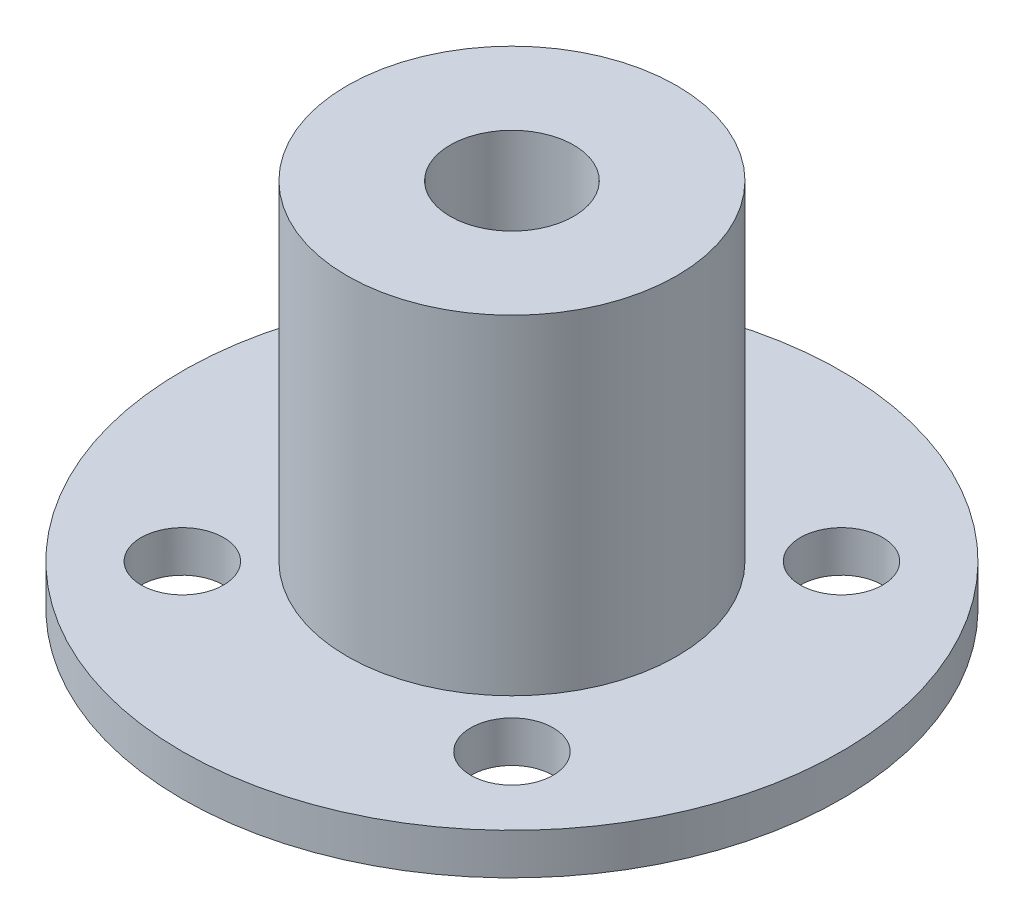
ISO-10303-21;
HEADER;
FILE_DESCRIPTION(('STEP AP214'),'2;1');
FILE_NAME('part.step','',(''),(''),'','','');
FILE_SCHEMA(('AUTOMOTIVE_DESIGN { 1 0 10303 214 1 1 1 1 }'));
ENDSEC;
DATA;
#1=APPLICATION_CONTEXT('core data for automotive mechanical design processes');
#2=APPLICATION_PROTOCOL_DEFINITION('international standard','automotive_design',2000,#1);
#3=PRODUCT_CONTEXT('',#1,'mechanical');
#4=PRODUCT('Part','Part','',(#3));
#5=PRODUCT_RELATED_PRODUCT_CATEGORY('part','',(#4));
#6=PRODUCT_DEFINITION_FORMATION('','',#4);
#7=PRODUCT_DEFINITION_CONTEXT('part definition',#1,'design');
#8=PRODUCT_DEFINITION('design','',#6,#7);
#9=PRODUCT_DEFINITION_SHAPE('','',#8);
#10=(LENGTH_UNIT() NAMED_UNIT(*) SI_UNIT(.MILLI.,.METRE.));
#11=(NAMED_UNIT(*) PLANE_ANGLE_UNIT() SI_UNIT($,.RADIAN.));
#12=(NAMED_UNIT(*) SI_UNIT($,.STERADIAN.) SOLID_ANGLE_UNIT());
#13=UNCERTAINTY_MEASURE_WITH_UNIT(LENGTH_MEASURE(1.E-05),#10,'distance_accuracy_value','');
#14=(GEOMETRIC_REPRESENTATION_CONTEXT(3) GLOBAL_UNCERTAINTY_ASSIGNED_CONTEXT((#13)) GLOBAL_UNIT_ASSIGNED_CONTEXT((#10,
#11,#12)) REPRESENTATION_CONTEXT('',''));
#15=CARTESIAN_POINT('',(0.,0.,0.));
#16=DIRECTION('',(0.,0.,1.));
#17=DIRECTION('',(1.,0.,0.));
#18=AXIS2_PLACEMENT_3D('',#15,#16,#17);
#19=CARTESIAN_POINT('',(0.,3.175,0.));
#20=DIRECTION('',(0.,1.,0.));
#21=DIRECTION('',(0.,0.,1.));
#22=AXIS2_PLACEMENT_3D('',#19,#20,#21);
#23=PLANE('',#22);
#24=CARTESIAN_POINT('',(-12.7,3.175,-12.7));
#25=DIRECTION('',(0.,1.,0.));
#26=DIRECTION('',(0.,0.,1.));
#27=AXIS2_PLACEMENT_3D('',#24,#25,#26);
#28=CIRCLE('',#27,3.175);
#29=CARTESIAN_POINT('',(-12.7,3.175,-9.525));
#30=VERTEX_POINT('',#29);
#31=EDGE_CURVE('E93',#30,#30,#28,.T.);
#32=ORIENTED_EDGE('',*,*,#31,.F.);
#33=EDGE_LOOP('',(#32));
#34=FACE_BOUND('',#33,.T.);
#35=CARTESIAN_POINT('',(12.7,3.175,-12.7));
#36=DIRECTION('',(0.,1.,0.));
#37=DIRECTION('',(0.,0.,1.));
#38=AXIS2_PLACEMENT_3D('',#35,#36,#37);
#39=CIRCLE('',#38,3.175);
#40=CARTESIAN_POINT('',(12.7,3.175,-9.525));
#41=VERTEX_POINT('',#40);
#42=EDGE_CURVE('E86',#41,#41,#39,.T.);
#43=ORIENTED_EDGE('',*,*,#42,.F.);
#44=EDGE_LOOP('',(#43));
#45=FACE_BOUND('',#44,.T.);
#46=CARTESIAN_POINT('',(12.7,3.175,12.7));
#47=DIRECTION('',(0.,1.,0.));
#48=DIRECTION('',(0.,0.,1.));
#49=AXIS2_PLACEMENT_3D('',#46,#47,#48);
#50=CIRCLE('',#49,3.175);
#51=CARTESIAN_POINT('',(12.7,3.175,15.875));
#52=VERTEX_POINT('',#51);
#53=EDGE_CURVE('E78',#52,#52,#50,.T.);
#54=ORIENTED_EDGE('',*,*,#53,.F.);
#55=EDGE_LOOP('',(#54));
#56=FACE_BOUND('',#55,.T.);
#57=CARTESIAN_POINT('',(-12.7,3.175,12.7));
#58=DIRECTION('',(0.,1.,0.));
#59=DIRECTION('',(0.,0.,1.));
#60=AXIS2_PLACEMENT_3D('',#57,#58,#59);
#61=CIRCLE('',#60,3.175);
#62=CARTESIAN_POINT('',(-12.7,3.175,15.875));
#63=VERTEX_POINT('',#62);
#64=EDGE_CURVE('E71',#63,#63,#61,.T.);
#65=ORIENTED_EDGE('',*,*,#64,.F.);
#66=EDGE_LOOP('',(#65));
#67=FACE_BOUND('',#66,.T.);
#68=CARTESIAN_POINT('',(0.,3.175,0.));
#69=DIRECTION('',(0.,1.,0.));
#70=DIRECTION('',(0.,0.,1.));
#71=AXIS2_PLACEMENT_3D('',#68,#69,#70);
#72=CIRCLE('',#71,25.4);
#73=CARTESIAN_POINT('',(0.,3.175,25.4));
#74=VERTEX_POINT('',#73);
#75=EDGE_CURVE('E45',#74,#74,#72,.T.);
#76=ORIENTED_EDGE('',*,*,#75,.T.);
#77=EDGE_LOOP('',(#76));
#78=FACE_BOUND('',#77,.T.);
#79=CARTESIAN_POINT('',(0.,3.175,0.));
#80=DIRECTION('',(0.,1.,0.));
#81=DIRECTION('',(0.,0.,1.));
#82=AXIS2_PLACEMENT_3D('',#79,#80,#81);
#83=CIRCLE('',#82,12.7);
#84=CARTESIAN_POINT('',(0.,3.175,12.7));
#85=VERTEX_POINT('',#84);
#86=EDGE_CURVE('E61',#85,#85,#83,.T.);
#87=ORIENTED_EDGE('',*,*,#86,.F.);
#88=EDGE_LOOP('',(#87));
#89=FACE_BOUND('',#88,.T.);
#90=ADVANCED_FACE('F37',(#34,#45,#56,#67,#78,#89),#23,.T.);
#91=CARTESIAN_POINT('',(0.,3.175,0.));
#92=DIRECTION('',(0.,-1.,0.));
#93=DIRECTION('',(0.,0.,-1.));
#94=AXIS2_PLACEMENT_3D('',#91,#92,#93);
#95=CYLINDRICAL_SURFACE('',#94,25.4);
#96=ORIENTED_EDGE('',*,*,#75,.F.);
#97=EDGE_LOOP('',(#96));
#98=FACE_BOUND('',#97,.T.);
#99=CARTESIAN_POINT('',(0.,0.,0.));
#100=DIRECTION('',(0.,1.,0.));
#101=DIRECTION('',(0.,0.,1.));
#102=AXIS2_PLACEMENT_3D('',#99,#100,#101);
#103=CIRCLE('',#102,25.4);
#104=CARTESIAN_POINT('',(0.,0.,25.4));
#105=VERTEX_POINT('',#104);
#106=EDGE_CURVE('E52',#105,#105,#103,.T.);
#107=ORIENTED_EDGE('',*,*,#106,.T.);
#108=EDGE_LOOP('',(#107));
#109=FACE_BOUND('',#108,.T.);
#110=ADVANCED_FACE('F39',(#98,#109),#95,.T.);
#111=CARTESIAN_POINT('',(0.,0.,0.));
#112=DIRECTION('',(0.,1.,0.));
#113=DIRECTION('',(0.,0.,1.));
#114=AXIS2_PLACEMENT_3D('',#111,#112,#113);
#115=PLANE('',#114);
#116=CARTESIAN_POINT('',(-12.7,0.,-12.7));
#117=DIRECTION('',(0.,-1.,0.));
#118=DIRECTION('',(0.,0.,1.));
#119=AXIS2_PLACEMENT_3D('',#116,#117,#118);
#120=CIRCLE('',#119,3.175);
#121=CARTESIAN_POINT('',(-12.7,0.,-9.525));
#122=VERTEX_POINT('',#121);
#123=EDGE_CURVE('E97',#122,#122,#120,.T.);
#124=ORIENTED_EDGE('',*,*,#123,.F.);
#125=EDGE_LOOP('',(#124));
#126=FACE_BOUND('',#125,.T.);
#127=CARTESIAN_POINT('',(12.7,0.,-12.7));
#128=DIRECTION('',(0.,-1.,0.));
#129=DIRECTION('',(0.,0.,-1.));
#130=AXIS2_PLACEMENT_3D('',#127,#128,#129);
#131=CIRCLE('',#130,3.175);
#132=CARTESIAN_POINT('',(12.7,0.,-15.875));
#133=VERTEX_POINT('',#132);
#134=EDGE_CURVE('E89',#133,#133,#131,.T.);
#135=ORIENTED_EDGE('',*,*,#134,.F.);
#136=EDGE_LOOP('',(#135));
#137=FACE_BOUND('',#136,.T.);
#138=CARTESIAN_POINT('',(12.7,0.,12.7));
#139=DIRECTION('',(0.,-1.,0.));
#140=DIRECTION('',(0.,0.,1.));
#141=AXIS2_PLACEMENT_3D('',#138,#139,#140);
#142=CIRCLE('',#141,3.175);
#143=CARTESIAN_POINT('',(12.7,0.,15.875));
#144=VERTEX_POINT('',#143);
#145=EDGE_CURVE('E82',#144,#144,#142,.T.);
#146=ORIENTED_EDGE('',*,*,#145,.F.);
#147=EDGE_LOOP('',(#146));
#148=FACE_BOUND('',#147,.T.);
#149=CARTESIAN_POINT('',(-12.7,0.,12.7));
#150=DIRECTION('',(0.,-1.,0.));
#151=DIRECTION('',(0.,0.,-1.));
#152=AXIS2_PLACEMENT_3D('',#149,#150,#151);
#153=CIRCLE('',#152,3.175);
#154=CARTESIAN_POINT('',(-12.7,0.,9.525));
#155=VERTEX_POINT('',#154);
#156=EDGE_CURVE('E75',#155,#155,#153,.T.);
#157=ORIENTED_EDGE('',*,*,#156,.F.);
#158=EDGE_LOOP('',(#157));
#159=FACE_BOUND('',#158,.T.);
#160=ORIENTED_EDGE('',*,*,#106,.F.);
#161=EDGE_LOOP('',(#160));
#162=FACE_BOUND('',#161,.T.);
#163=ADVANCED_FACE('F104',(#126,#137,#148,#159,#162),#115,.F.);
#164=CARTESIAN_POINT('',(0.,28.575,0.));
#165=DIRECTION('',(0.,1.,0.));
#166=DIRECTION('',(0.,0.,1.));
#167=AXIS2_PLACEMENT_3D('',#164,#165,#166);
#168=PLANE('',#167);
#169=CARTESIAN_POINT('',(0.,28.575,0.));
#170=DIRECTION('',(0.,1.,0.));
#171=DIRECTION('',(0.,0.,1.));
#172=AXIS2_PLACEMENT_3D('',#169,#170,#171);
#173=CIRCLE('',#172,12.7);
#174=CARTESIAN_POINT('',(0.,28.575,12.7));
#175=VERTEX_POINT('',#174);
#176=EDGE_CURVE('E59',#175,#175,#173,.T.);
#177=ORIENTED_EDGE('',*,*,#176,.T.);
#178=EDGE_LOOP('',(#177));
#179=FACE_BOUND('',#178,.T.);
#180=CARTESIAN_POINT('',(0.,28.575,0.));
#181=DIRECTION('',(0.,1.,0.));
#182=DIRECTION('',(0.,0.,1.));
#183=AXIS2_PLACEMENT_3D('',#180,#181,#182);
#184=CIRCLE('',#183,4.7625);
#185=CARTESIAN_POINT('',(0.,28.575,4.7625));
#186=VERTEX_POINT('',#185);
#187=EDGE_CURVE('E65',#186,#186,#184,.T.);
#188=ORIENTED_EDGE('',*,*,#187,.F.);
#189=EDGE_LOOP('',(#188));
#190=FACE_BOUND('',#189,.T.);
#191=ADVANCED_FACE('F107',(#179,#190),#168,.T.);
#192=CARTESIAN_POINT('',(0.,28.575,0.));
#193=DIRECTION('',(0.,-1.,0.));
#194=DIRECTION('',(0.,0.,-1.));
#195=AXIS2_PLACEMENT_3D('',#192,#193,#194);
#196=CYLINDRICAL_SURFACE('',#195,12.7);
#197=ORIENTED_EDGE('',*,*,#176,.F.);
#198=EDGE_LOOP('',(#197));
#199=FACE_BOUND('',#198,.T.);
#200=ORIENTED_EDGE('',*,*,#86,.T.);
#201=EDGE_LOOP('',(#200));
#202=FACE_BOUND('',#201,.T.);
#203=ADVANCED_FACE('F140',(#199,#202),#196,.T.);
#204=CARTESIAN_POINT('',(0.,28.575,0.));
#205=DIRECTION('',(0.,-1.,0.));
#206=DIRECTION('',(0.,0.,-1.));
#207=AXIS2_PLACEMENT_3D('',#204,#205,#206);
#208=CYLINDRICAL_SURFACE('',#207,4.7625);
#209=ORIENTED_EDGE('',*,*,#187,.T.);
#210=EDGE_LOOP('',(#209));
#211=FACE_BOUND('',#210,.T.);
#212=CARTESIAN_POINT('',(0.,3.175,0.));
#213=DIRECTION('',(0.,1.,0.));
#214=DIRECTION('',(0.,0.,1.));
#215=AXIS2_PLACEMENT_3D('',#212,#213,#214);
#216=CIRCLE('',#215,4.7625);
#217=CARTESIAN_POINT('',(0.,3.175,4.7625));
#218=VERTEX_POINT('',#217);
#219=EDGE_CURVE('E10',#218,#218,#216,.F.);
#220=ORIENTED_EDGE('',*,*,#219,.T.);
#221=EDGE_LOOP('',(#220));
#222=FACE_BOUND('',#221,.T.);
#223=ADVANCED_FACE('F131',(#211,#222),#208,.F.);
#224=ORIENTED_EDGE('',*,*,#219,.F.);
#225=EDGE_LOOP('',(#224));
#226=FACE_BOUND('',#225,.T.);
#227=ADVANCED_FACE('F123',(#226),#23,.T.);
#228=CARTESIAN_POINT('',(-12.7,28.575,12.7));
#229=DIRECTION('',(0.,-1.,0.));
#230=DIRECTION('',(0.,0.,-1.));
#231=AXIS2_PLACEMENT_3D('',#228,#229,#230);
#232=CYLINDRICAL_SURFACE('',#231,3.175);
#233=ORIENTED_EDGE('',*,*,#64,.T.);
#234=EDGE_LOOP('',(#233));
#235=FACE_BOUND('',#234,.T.);
#236=ORIENTED_EDGE('',*,*,#156,.T.);
#237=EDGE_LOOP('',(#236));
#238=FACE_BOUND('',#237,.T.);
#239=ADVANCED_FACE('F130',(#235,#238),#232,.F.);
#240=CARTESIAN_POINT('',(12.7,28.575,12.7));
#241=DIRECTION('',(0.,-1.,0.));
#242=DIRECTION('',(0.,0.,-1.));
#243=AXIS2_PLACEMENT_3D('',#240,#241,#242);
#244=CYLINDRICAL_SURFACE('',#243,3.175);
#245=ORIENTED_EDGE('',*,*,#53,.T.);
#246=EDGE_LOOP('',(#245));
#247=FACE_BOUND('',#246,.T.);
#248=ORIENTED_EDGE('',*,*,#145,.T.);
#249=EDGE_LOOP('',(#248));
#250=FACE_BOUND('',#249,.T.);
#251=ADVANCED_FACE('F137',(#247,#250),#244,.F.);
#252=CARTESIAN_POINT('',(12.7,28.575,-12.7));
#253=DIRECTION('',(0.,-1.,0.));
#254=DIRECTION('',(0.,0.,-1.));
#255=AXIS2_PLACEMENT_3D('',#252,#253,#254);
#256=CYLINDRICAL_SURFACE('',#255,3.175);
#257=ORIENTED_EDGE('',*,*,#42,.T.);
#258=EDGE_LOOP('',(#257));
#259=FACE_BOUND('',#258,.T.);
#260=ORIENTED_EDGE('',*,*,#134,.T.);
#261=EDGE_LOOP('',(#260));
#262=FACE_BOUND('',#261,.T.);
#263=ADVANCED_FACE('F202',(#259,#262),#256,.F.);
#264=CARTESIAN_POINT('',(-12.7,28.575,-12.7));
#265=DIRECTION('',(0.,-1.,0.));
#266=DIRECTION('',(0.,0.,-1.));
#267=AXIS2_PLACEMENT_3D('',#264,#265,#266);
#268=CYLINDRICAL_SURFACE('',#267,3.175);
#269=ORIENTED_EDGE('',*,*,#31,.T.);
#270=EDGE_LOOP('',(#269));
#271=FACE_BOUND('',#270,.T.);
#272=ORIENTED_EDGE('',*,*,#123,.T.);
#273=EDGE_LOOP('',(#272));
#274=FACE_BOUND('',#273,.T.);
#275=ADVANCED_FACE('F102',(#271,#274),#268,.F.);
#276=CLOSED_SHELL('',(#90,#110,#163,#191,#203,#223,#227,#239,#251,#263,#275));
#277=MANIFOLD_SOLID_BREP('B2',#276);
#278=ADVANCED_BREP_SHAPE_REPRESENTATION('',(#18,#277),#14);
#279=SHAPE_DEFINITION_REPRESENTATION(#9,#278);
ENDSEC;
END-ISO-10303-21;
